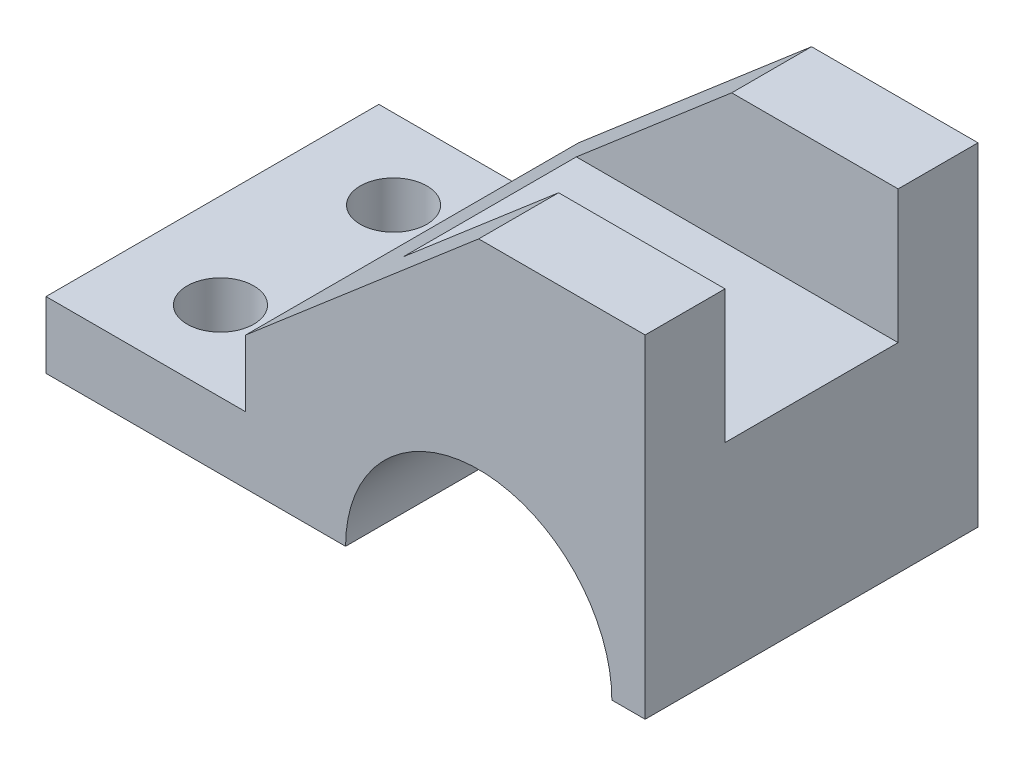
ISO-10303-21;
HEADER;
FILE_DESCRIPTION(('STEP AP214'),'2;1');
FILE_NAME('part.step','',(''),(''),'','','');
FILE_SCHEMA(('AUTOMOTIVE_DESIGN { 1 0 10303 214 1 1 1 1 }'));
ENDSEC;
DATA;
#1=APPLICATION_CONTEXT('core data for automotive mechanical design processes');
#2=APPLICATION_PROTOCOL_DEFINITION('international standard','automotive_design',2000,#1);
#3=PRODUCT_CONTEXT('',#1,'mechanical');
#4=PRODUCT('Part','Part','',(#3));
#5=PRODUCT_RELATED_PRODUCT_CATEGORY('part','',(#4));
#6=PRODUCT_DEFINITION_FORMATION('','',#4);
#7=PRODUCT_DEFINITION_CONTEXT('part definition',#1,'design');
#8=PRODUCT_DEFINITION('design','',#6,#7);
#9=PRODUCT_DEFINITION_SHAPE('','',#8);
#10=(LENGTH_UNIT() NAMED_UNIT(*) SI_UNIT(.MILLI.,.METRE.));
#11=(NAMED_UNIT(*) PLANE_ANGLE_UNIT() SI_UNIT($,.RADIAN.));
#12=(NAMED_UNIT(*) SI_UNIT($,.STERADIAN.) SOLID_ANGLE_UNIT());
#13=UNCERTAINTY_MEASURE_WITH_UNIT(LENGTH_MEASURE(1.E-05),#10,'distance_accuracy_value','');
#14=(GEOMETRIC_REPRESENTATION_CONTEXT(3) GLOBAL_UNCERTAINTY_ASSIGNED_CONTEXT((#13)) GLOBAL_UNIT_ASSIGNED_CONTEXT((#10,
#11,#12)) REPRESENTATION_CONTEXT('',''));
#15=CARTESIAN_POINT('',(0.,0.,0.));
#16=DIRECTION('',(0.,0.,1.));
#17=DIRECTION('',(1.,0.,0.));
#18=AXIS2_PLACEMENT_3D('',#15,#16,#17);
#19=CARTESIAN_POINT('',(21.0794353078974,28.4104255181365,-50.));
#20=DIRECTION('',(0.,1.,0.));
#21=DIRECTION('',(0.,0.,1.));
#22=AXIS2_PLACEMENT_3D('',#19,#20,#21);
#23=PLANE('',#22);
#24=DIRECTION('',(1.,0.,0.));
#25=VECTOR('',#24,1.);
#26=CARTESIAN_POINT('',(-78.9205646921026,28.4104255181365,-38.));
#27=LINE('',#26,#25);
#28=CARTESIAN_POINT('',(-3.92056469210261,28.4104255181365,-38.));
#29=VERTEX_POINT('',#28);
#30=CARTESIAN_POINT('',(21.0794353078974,28.4104255181365,-38.));
#31=VERTEX_POINT('',#30);
#32=EDGE_CURVE('E251',#29,#31,#27,.T.);
#33=ORIENTED_EDGE('',*,*,#32,.T.);
#34=DIRECTION('',(0.,0.,1.));
#35=VECTOR('',#34,1.);
#36=CARTESIAN_POINT('',(21.0794353078974,28.4104255181365,-50.));
#37=LINE('',#36,#35);
#38=CARTESIAN_POINT('',(21.0794353078974,28.4104255181365,-50.));
#39=VERTEX_POINT('',#38);
#40=EDGE_CURVE('E180',#39,#31,#37,.T.);
#41=ORIENTED_EDGE('',*,*,#40,.F.);
#42=DIRECTION('',(-1.,0.,0.));
#43=VECTOR('',#42,1.);
#44=CARTESIAN_POINT('',(21.0794353078974,28.4104255181365,-50.));
#45=LINE('',#44,#43);
#46=CARTESIAN_POINT('',(-3.92056469210262,28.4104255181365,-50.));
#47=VERTEX_POINT('',#46);
#48=EDGE_CURVE('E144',#39,#47,#45,.T.);
#49=ORIENTED_EDGE('',*,*,#48,.T.);
#50=DIRECTION('',(0.,0.,1.));
#51=VECTOR('',#50,1.);
#52=CARTESIAN_POINT('',(-3.92056469210262,28.4104255181365,-50.));
#53=LINE('',#52,#51);
#54=EDGE_CURVE('E131',#47,#29,#53,.T.);
#55=ORIENTED_EDGE('',*,*,#54,.T.);
#56=EDGE_LOOP('',(#33,#41,#49,#55));
#57=FACE_BOUND('',#56,.T.);
#58=ADVANCED_FACE('F33',(#57),#23,.T.);
#59=CARTESIAN_POINT('',(-68.9205646921026,-21.5895744818635,-50.));
#60=DIRECTION('',(-1.,0.,0.));
#61=DIRECTION('',(0.,0.,1.));
#62=AXIS2_PLACEMENT_3D('',#59,#60,#61);
#63=PLANE('',#62);
#64=DIRECTION('',(0.,-1.,0.));
#65=VECTOR('',#64,1.);
#66=CARTESIAN_POINT('',(-68.9205646921026,-21.5895744818635,0.));
#67=LINE('',#66,#65);
#68=CARTESIAN_POINT('',(-68.9205646921026,-11.5895744818635,0.));
#69=VERTEX_POINT('',#68);
#70=CARTESIAN_POINT('',(-68.9205646921026,-21.5895744818635,0.));
#71=VERTEX_POINT('',#70);
#72=EDGE_CURVE('E151',#69,#71,#67,.T.);
#73=ORIENTED_EDGE('',*,*,#72,.F.);
#74=DIRECTION('',(0.,0.,1.));
#75=VECTOR('',#74,1.);
#76=CARTESIAN_POINT('',(-68.9205646921026,-11.5895744818635,-50.));
#77=LINE('',#76,#75);
#78=CARTESIAN_POINT('',(-68.9205646921026,-11.5895744818635,-50.));
#79=VERTEX_POINT('',#78);
#80=EDGE_CURVE('E11',#79,#69,#77,.T.);
#81=ORIENTED_EDGE('',*,*,#80,.F.);
#82=DIRECTION('',(0.,-1.,0.));
#83=VECTOR('',#82,1.);
#84=CARTESIAN_POINT('',(-68.9205646921026,-21.5895744818635,-50.));
#85=LINE('',#84,#83);
#86=CARTESIAN_POINT('',(-68.9205646921026,-21.5895744818635,-50.));
#87=VERTEX_POINT('',#86);
#88=EDGE_CURVE('E175',#79,#87,#85,.T.);
#89=ORIENTED_EDGE('',*,*,#88,.T.);
#90=DIRECTION('',(0.,0.,1.));
#91=VECTOR('',#90,1.);
#92=CARTESIAN_POINT('',(-68.9205646921026,-21.5895744818635,-50.));
#93=LINE('',#92,#91);
#94=EDGE_CURVE('E37',#87,#71,#93,.T.);
#95=ORIENTED_EDGE('',*,*,#94,.T.);
#96=EDGE_LOOP('',(#73,#81,#89,#95));
#97=FACE_BOUND('',#96,.T.);
#98=ADVANCED_FACE('F35',(#97),#63,.T.);
#99=CARTESIAN_POINT('',(-68.9205646921026,-11.5895744818635,-50.));
#100=DIRECTION('',(0.,1.,0.));
#101=DIRECTION('',(0.,0.,1.));
#102=AXIS2_PLACEMENT_3D('',#99,#100,#101);
#103=PLANE('',#102);
#104=CARTESIAN_POINT('',(-54.7121009661851,-11.5895744818635,-12.));
#105=DIRECTION('',(0.,1.,0.));
#106=DIRECTION('',(0.,0.,-1.));
#107=AXIS2_PLACEMENT_3D('',#104,#105,#106);
#108=CIRCLE('',#107,5.);
#109=CARTESIAN_POINT('',(-54.7121009661851,-11.5895744818635,-17.));
#110=VERTEX_POINT('',#109);
#111=EDGE_CURVE('E265',#110,#110,#108,.T.);
#112=ORIENTED_EDGE('',*,*,#111,.F.);
#113=EDGE_LOOP('',(#112));
#114=FACE_BOUND('',#113,.T.);
#115=CARTESIAN_POINT('',(-54.7121009661851,-11.5895744818635,-38.));
#116=DIRECTION('',(0.,1.,0.));
#117=DIRECTION('',(0.,0.,1.));
#118=AXIS2_PLACEMENT_3D('',#115,#116,#117);
#119=CIRCLE('',#118,5.);
#120=CARTESIAN_POINT('',(-54.7121009661851,-11.5895744818635,-33.));
#121=VERTEX_POINT('',#120);
#122=EDGE_CURVE('E269',#121,#121,#119,.T.);
#123=ORIENTED_EDGE('',*,*,#122,.F.);
#124=EDGE_LOOP('',(#123));
#125=FACE_BOUND('',#124,.T.);
#126=DIRECTION('',(-1.,0.,0.));
#127=VECTOR('',#126,1.);
#128=CARTESIAN_POINT('',(-68.9205646921026,-11.5895744818635,0.));
#129=LINE('',#128,#127);
#130=CARTESIAN_POINT('',(-38.9205646921026,-11.5895744818635,0.));
#131=VERTEX_POINT('',#130);
#132=EDGE_CURVE('E173',#131,#69,#129,.T.);
#133=ORIENTED_EDGE('',*,*,#132,.F.);
#134=DIRECTION('',(0.,0.,1.));
#135=VECTOR('',#134,1.);
#136=CARTESIAN_POINT('',(-38.9205646921026,-11.5895744818635,-50.));
#137=LINE('',#136,#135);
#138=CARTESIAN_POINT('',(-38.9205646921026,-11.5895744818635,-50.));
#139=VERTEX_POINT('',#138);
#140=EDGE_CURVE('E42',#139,#131,#137,.T.);
#141=ORIENTED_EDGE('',*,*,#140,.F.);
#142=DIRECTION('',(-1.,0.,0.));
#143=VECTOR('',#142,1.);
#144=CARTESIAN_POINT('',(-68.9205646921026,-11.5895744818635,-50.));
#145=LINE('',#144,#143);
#146=EDGE_CURVE('E139',#139,#79,#145,.T.);
#147=ORIENTED_EDGE('',*,*,#146,.T.);
#148=ORIENTED_EDGE('',*,*,#80,.T.);
#149=EDGE_LOOP('',(#133,#141,#147,#148));
#150=FACE_BOUND('',#149,.T.);
#151=ADVANCED_FACE('F192',(#114,#125,#150),#103,.T.);
#152=CARTESIAN_POINT('',(-38.9205646921026,-11.5895744818635,-50.));
#153=DIRECTION('',(-1.,0.,0.));
#154=DIRECTION('',(0.,0.,1.));
#155=AXIS2_PLACEMENT_3D('',#152,#153,#154);
#156=PLANE('',#155);
#157=DIRECTION('',(0.,-1.,0.));
#158=VECTOR('',#157,1.);
#159=CARTESIAN_POINT('',(-38.9205646921026,-11.5895744818635,0.));
#160=LINE('',#159,#158);
#161=CARTESIAN_POINT('',(-38.9205646921026,-1.58957448186347,0.));
#162=VERTEX_POINT('',#161);
#163=EDGE_CURVE('E126',#162,#131,#160,.T.);
#164=ORIENTED_EDGE('',*,*,#163,.F.);
#165=DIRECTION('',(0.,0.,1.));
#166=VECTOR('',#165,1.);
#167=CARTESIAN_POINT('',(-38.9205646921026,-1.58957448186347,-50.));
#168=LINE('',#167,#166);
#169=CARTESIAN_POINT('',(-38.9205646921026,-1.58957448186347,-50.));
#170=VERTEX_POINT('',#169);
#171=EDGE_CURVE('E120',#170,#162,#168,.T.);
#172=ORIENTED_EDGE('',*,*,#171,.F.);
#173=DIRECTION('',(0.,-1.,0.));
#174=VECTOR('',#173,1.);
#175=CARTESIAN_POINT('',(-38.9205646921026,-11.5895744818635,-50.));
#176=LINE('',#175,#174);
#177=EDGE_CURVE('E123',#170,#139,#176,.T.);
#178=ORIENTED_EDGE('',*,*,#177,.T.);
#179=ORIENTED_EDGE('',*,*,#140,.T.);
#180=EDGE_LOOP('',(#164,#172,#178,#179));
#181=FACE_BOUND('',#180,.T.);
#182=ADVANCED_FACE('F122',(#181),#156,.T.);
#183=CARTESIAN_POINT('',(-38.9205646921026,-1.58957448186347,-50.));
#184=DIRECTION('',(-0.650791373455969,0.759256602365297,0.));
#185=DIRECTION('',(-0.759256602365296,-0.650791373455969,0.));
#186=AXIS2_PLACEMENT_3D('',#183,#184,#185);
#187=PLANE('',#186);
#188=DIRECTION('',(-0.759256602365296,-0.650791373455969,0.));
#189=VECTOR('',#188,1.);
#190=CARTESIAN_POINT('',(-38.9205646921026,-1.58957448186347,-38.));
#191=LINE('',#190,#189);
#192=CARTESIAN_POINT('',(-27.253898025436,8.41042551813654,-38.));
#193=VERTEX_POINT('',#192);
#194=EDGE_CURVE('E262',#29,#193,#191,.T.);
#195=ORIENTED_EDGE('',*,*,#194,.F.);
#196=ORIENTED_EDGE('',*,*,#54,.F.);
#197=DIRECTION('',(-0.759256602365297,-0.650791373455969,0.));
#198=VECTOR('',#197,1.);
#199=CARTESIAN_POINT('',(-38.9205646921026,-1.58957448186347,-50.));
#200=LINE('',#199,#198);
#201=EDGE_CURVE('E137',#47,#170,#200,.T.);
#202=ORIENTED_EDGE('',*,*,#201,.T.);
#203=ORIENTED_EDGE('',*,*,#171,.T.);
#204=DIRECTION('',(-0.759256602365297,-0.650791373455969,0.));
#205=VECTOR('',#204,1.);
#206=CARTESIAN_POINT('',(-38.9205646921026,-1.58957448186347,0.));
#207=LINE('',#206,#205);
#208=CARTESIAN_POINT('',(-3.92056469210262,28.4104255181365,0.));
#209=VERTEX_POINT('',#208);
#210=EDGE_CURVE('E170',#209,#162,#207,.T.);
#211=ORIENTED_EDGE('',*,*,#210,.F.);
#212=CARTESIAN_POINT('',(-3.92056469210261,28.4104255181365,-12.));
#213=VERTEX_POINT('',#212);
#214=EDGE_CURVE('E179',#213,#209,#53,.T.);
#215=ORIENTED_EDGE('',*,*,#214,.F.);
#216=DIRECTION('',(0.759256602365296,0.650791373455969,0.));
#217=VECTOR('',#216,1.);
#218=CARTESIAN_POINT('',(-38.9205646921026,-1.58957448186346,-12.));
#219=LINE('',#218,#217);
#220=CARTESIAN_POINT('',(-27.2538980254359,8.41042551813654,-12.));
#221=VERTEX_POINT('',#220);
#222=EDGE_CURVE('E234',#221,#213,#219,.T.);
#223=ORIENTED_EDGE('',*,*,#222,.F.);
#224=DIRECTION('',(0.,0.,1.));
#225=VECTOR('',#224,1.);
#226=CARTESIAN_POINT('',(-27.253898025436,8.41042551813654,-50.));
#227=LINE('',#226,#225);
#228=EDGE_CURVE('E259',#193,#221,#227,.T.);
#229=ORIENTED_EDGE('',*,*,#228,.F.);
#230=EDGE_LOOP('',(#195,#196,#202,#203,#211,#215,#223,#229));
#231=FACE_BOUND('',#230,.T.);
#232=ADVANCED_FACE('F142',(#231),#187,.T.);
#233=DIRECTION('',(1.,0.,0.));
#234=VECTOR('',#233,1.);
#235=CARTESIAN_POINT('',(-78.9205646921026,28.4104255181365,-12.));
#236=LINE('',#235,#234);
#237=CARTESIAN_POINT('',(21.0794353078974,28.4104255181365,-12.));
#238=VERTEX_POINT('',#237);
#239=EDGE_CURVE('E50',#213,#238,#236,.T.);
#240=ORIENTED_EDGE('',*,*,#239,.F.);
#241=ORIENTED_EDGE('',*,*,#214,.T.);
#242=DIRECTION('',(-1.,0.,0.));
#243=VECTOR('',#242,1.);
#244=CARTESIAN_POINT('',(21.0794353078974,28.4104255181365,0.));
#245=LINE('',#244,#243);
#246=CARTESIAN_POINT('',(21.0794353078974,28.4104255181365,0.));
#247=VERTEX_POINT('',#246);
#248=EDGE_CURVE('E167',#247,#209,#245,.T.);
#249=ORIENTED_EDGE('',*,*,#248,.F.);
#250=EDGE_CURVE('E183',#238,#247,#37,.T.);
#251=ORIENTED_EDGE('',*,*,#250,.F.);
#252=EDGE_LOOP('',(#240,#241,#249,#251));
#253=FACE_BOUND('',#252,.T.);
#254=ADVANCED_FACE('F207',(#253),#23,.T.);
#255=CARTESIAN_POINT('',(21.0794353078974,-21.5895744818635,-50.));
#256=DIRECTION('',(1.,0.,0.));
#257=DIRECTION('',(0.,0.,-1.));
#258=AXIS2_PLACEMENT_3D('',#255,#256,#257);
#259=PLANE('',#258);
#260=DIRECTION('',(0.,1.,0.));
#261=VECTOR('',#260,1.);
#262=CARTESIAN_POINT('',(21.0794353078974,8.41042551813654,-38.));
#263=LINE('',#262,#261);
#264=CARTESIAN_POINT('',(21.0794353078974,8.41042551813654,-38.));
#265=VERTEX_POINT('',#264);
#266=EDGE_CURVE('E230',#265,#31,#263,.T.);
#267=ORIENTED_EDGE('',*,*,#266,.F.);
#268=DIRECTION('',(0.,0.,-1.));
#269=VECTOR('',#268,1.);
#270=CARTESIAN_POINT('',(21.0794353078974,8.41042551813654,-12.));
#271=LINE('',#270,#269);
#272=CARTESIAN_POINT('',(21.0794353078974,8.41042551813654,-12.));
#273=VERTEX_POINT('',#272);
#274=EDGE_CURVE('E244',#273,#265,#271,.T.);
#275=ORIENTED_EDGE('',*,*,#274,.F.);
#276=DIRECTION('',(0.,-1.,0.));
#277=VECTOR('',#276,1.);
#278=CARTESIAN_POINT('',(21.0794353078974,28.4104255181365,-12.));
#279=LINE('',#278,#277);
#280=EDGE_CURVE('E241',#238,#273,#279,.T.);
#281=ORIENTED_EDGE('',*,*,#280,.F.);
#282=ORIENTED_EDGE('',*,*,#250,.T.);
#283=DIRECTION('',(0.,1.,0.));
#284=VECTOR('',#283,1.);
#285=CARTESIAN_POINT('',(21.0794353078974,-21.5895744818635,0.));
#286=LINE('',#285,#284);
#287=CARTESIAN_POINT('',(21.0794353078974,-21.5895744818635,0.));
#288=VERTEX_POINT('',#287);
#289=EDGE_CURVE('E164',#288,#247,#286,.T.);
#290=ORIENTED_EDGE('',*,*,#289,.F.);
#291=DIRECTION('',(0.,0.,1.));
#292=VECTOR('',#291,1.);
#293=CARTESIAN_POINT('',(21.0794353078974,-21.5895744818635,-50.));
#294=LINE('',#293,#292);
#295=CARTESIAN_POINT('',(21.0794353078974,-21.5895744818635,-50.));
#296=VERTEX_POINT('',#295);
#297=EDGE_CURVE('E184',#296,#288,#294,.T.);
#298=ORIENTED_EDGE('',*,*,#297,.F.);
#299=DIRECTION('',(0.,1.,0.));
#300=VECTOR('',#299,1.);
#301=CARTESIAN_POINT('',(21.0794353078974,-21.5895744818635,-50.));
#302=LINE('',#301,#300);
#303=EDGE_CURVE('E146',#296,#39,#302,.T.);
#304=ORIENTED_EDGE('',*,*,#303,.T.);
#305=ORIENTED_EDGE('',*,*,#40,.T.);
#306=EDGE_LOOP('',(#267,#275,#281,#282,#290,#298,#304,#305));
#307=FACE_BOUND('',#306,.T.);
#308=ADVANCED_FACE('F214',(#307),#259,.T.);
#309=CARTESIAN_POINT('',(16.0794353078974,-21.5895744818635,-50.));
#310=DIRECTION('',(0.,-1.,0.));
#311=DIRECTION('',(0.,0.,-1.));
#312=AXIS2_PLACEMENT_3D('',#309,#310,#311);
#313=PLANE('',#312);
#314=DIRECTION('',(1.,0.,0.));
#315=VECTOR('',#314,1.);
#316=CARTESIAN_POINT('',(16.0794353078974,-21.5895744818635,0.));
#317=LINE('',#316,#315);
#318=CARTESIAN_POINT('',(16.0794353078974,-21.5895744818635,0.));
#319=VERTEX_POINT('',#318);
#320=EDGE_CURVE('E161',#319,#288,#317,.T.);
#321=ORIENTED_EDGE('',*,*,#320,.F.);
#322=DIRECTION('',(0.,0.,1.));
#323=VECTOR('',#322,1.);
#324=CARTESIAN_POINT('',(16.0794353078974,-21.5895744818635,-50.));
#325=LINE('',#324,#323);
#326=CARTESIAN_POINT('',(16.0794353078974,-21.5895744818635,-50.));
#327=VERTEX_POINT('',#326);
#328=EDGE_CURVE('E186',#327,#319,#325,.T.);
#329=ORIENTED_EDGE('',*,*,#328,.F.);
#330=DIRECTION('',(1.,0.,0.));
#331=VECTOR('',#330,1.);
#332=CARTESIAN_POINT('',(16.0794353078974,-21.5895744818635,-50.));
#333=LINE('',#332,#331);
#334=EDGE_CURVE('E282',#327,#296,#333,.T.);
#335=ORIENTED_EDGE('',*,*,#334,.T.);
#336=ORIENTED_EDGE('',*,*,#297,.T.);
#337=EDGE_LOOP('',(#321,#329,#335,#336));
#338=FACE_BOUND('',#337,.T.);
#339=ADVANCED_FACE('F220',(#338),#313,.T.);
#340=CARTESIAN_POINT('',(-3.92056469210262,-21.5895744818635,-50.));
#341=DIRECTION('',(0.,0.,1.));
#342=DIRECTION('',(1.,0.,0.));
#343=AXIS2_PLACEMENT_3D('',#340,#341,#342);
#344=CYLINDRICAL_SURFACE('',#343,20.);
#345=CARTESIAN_POINT('',(-3.92056469210262,-21.5895744818635,0.));
#346=DIRECTION('',(0.,0.,-1.));
#347=DIRECTION('',(-1.,0.,0.));
#348=AXIS2_PLACEMENT_3D('',#345,#346,#347);
#349=CIRCLE('',#348,20.);
#350=CARTESIAN_POINT('',(-23.9205646921026,-21.5895744818635,0.));
#351=VERTEX_POINT('',#350);
#352=EDGE_CURVE('E158',#351,#319,#349,.T.);
#353=ORIENTED_EDGE('',*,*,#352,.F.);
#354=DIRECTION('',(0.,0.,1.));
#355=VECTOR('',#354,1.);
#356=CARTESIAN_POINT('',(-23.9205646921026,-21.5895744818635,-50.));
#357=LINE('',#356,#355);
#358=CARTESIAN_POINT('',(-23.9205646921026,-21.5895744818635,-50.));
#359=VERTEX_POINT('',#358);
#360=EDGE_CURVE('E187',#359,#351,#357,.T.);
#361=ORIENTED_EDGE('',*,*,#360,.F.);
#362=CARTESIAN_POINT('',(-3.92056469210262,-21.5895744818635,-50.));
#363=DIRECTION('',(0.,0.,-1.));
#364=DIRECTION('',(-1.,0.,0.));
#365=AXIS2_PLACEMENT_3D('',#362,#363,#364);
#366=CIRCLE('',#365,20.);
#367=EDGE_CURVE('E279',#359,#327,#366,.T.);
#368=ORIENTED_EDGE('',*,*,#367,.T.);
#369=ORIENTED_EDGE('',*,*,#328,.T.);
#370=EDGE_LOOP('',(#353,#361,#368,#369));
#371=FACE_BOUND('',#370,.T.);
#372=ADVANCED_FACE('F288',(#371),#344,.F.);
#373=CARTESIAN_POINT('',(-68.9205646921026,-21.5895744818635,-50.));
#374=DIRECTION('',(0.,-1.,0.));
#375=DIRECTION('',(0.,0.,-1.));
#376=AXIS2_PLACEMENT_3D('',#373,#374,#375);
#377=PLANE('',#376);
#378=CARTESIAN_POINT('',(-54.7121009661851,-21.5895744818635,-12.));
#379=DIRECTION('',(0.,1.,0.));
#380=DIRECTION('',(0.,0.,-1.));
#381=AXIS2_PLACEMENT_3D('',#378,#379,#380);
#382=CIRCLE('',#381,5.);
#383=CARTESIAN_POINT('',(-54.7121009661851,-21.5895744818635,-17.));
#384=VERTEX_POINT('',#383);
#385=EDGE_CURVE('E266',#384,#384,#382,.T.);
#386=ORIENTED_EDGE('',*,*,#385,.T.);
#387=EDGE_LOOP('',(#386));
#388=FACE_BOUND('',#387,.T.);
#389=CARTESIAN_POINT('',(-54.7121009661851,-21.5895744818635,-38.));
#390=DIRECTION('',(0.,1.,0.));
#391=DIRECTION('',(0.,0.,1.));
#392=AXIS2_PLACEMENT_3D('',#389,#390,#391);
#393=CIRCLE('',#392,5.);
#394=CARTESIAN_POINT('',(-54.7121009661851,-21.5895744818635,-33.));
#395=VERTEX_POINT('',#394);
#396=EDGE_CURVE('E155',#395,#395,#393,.T.);
#397=ORIENTED_EDGE('',*,*,#396,.T.);
#398=EDGE_LOOP('',(#397));
#399=FACE_BOUND('',#398,.T.);
#400=DIRECTION('',(1.,0.,0.));
#401=VECTOR('',#400,1.);
#402=CARTESIAN_POINT('',(-68.9205646921026,-21.5895744818635,0.));
#403=LINE('',#402,#401);
#404=EDGE_CURVE('E154',#71,#351,#403,.T.);
#405=ORIENTED_EDGE('',*,*,#404,.F.);
#406=ORIENTED_EDGE('',*,*,#94,.F.);
#407=DIRECTION('',(1.,0.,0.));
#408=VECTOR('',#407,1.);
#409=CARTESIAN_POINT('',(-68.9205646921026,-21.5895744818635,-50.));
#410=LINE('',#409,#408);
#411=EDGE_CURVE('E277',#87,#359,#410,.T.);
#412=ORIENTED_EDGE('',*,*,#411,.T.);
#413=ORIENTED_EDGE('',*,*,#360,.T.);
#414=EDGE_LOOP('',(#405,#406,#412,#413));
#415=FACE_BOUND('',#414,.T.);
#416=ADVANCED_FACE('F189',(#388,#399,#415),#377,.T.);
#417=CARTESIAN_POINT('',(-3.92056469210262,-21.5895744818635,-50.));
#418=DIRECTION('',(0.,0.,-1.));
#419=DIRECTION('',(-1.,0.,0.));
#420=AXIS2_PLACEMENT_3D('',#417,#418,#419);
#421=PLANE('',#420);
#422=ORIENTED_EDGE('',*,*,#88,.F.);
#423=ORIENTED_EDGE('',*,*,#146,.F.);
#424=ORIENTED_EDGE('',*,*,#177,.F.);
#425=ORIENTED_EDGE('',*,*,#201,.F.);
#426=ORIENTED_EDGE('',*,*,#48,.F.);
#427=ORIENTED_EDGE('',*,*,#303,.F.);
#428=ORIENTED_EDGE('',*,*,#334,.F.);
#429=ORIENTED_EDGE('',*,*,#367,.F.);
#430=ORIENTED_EDGE('',*,*,#411,.F.);
#431=EDGE_LOOP('',(#422,#423,#424,#425,#426,#427,#428,#429,#430));
#432=FACE_BOUND('',#431,.T.);
#433=ADVANCED_FACE('F135',(#432),#421,.T.);
#434=CARTESIAN_POINT('',(-3.92056469210262,-21.5895744818635,0.));
#435=DIRECTION('',(0.,0.,-1.));
#436=DIRECTION('',(-1.,0.,0.));
#437=AXIS2_PLACEMENT_3D('',#434,#435,#436);
#438=PLANE('',#437);
#439=ORIENTED_EDGE('',*,*,#72,.T.);
#440=ORIENTED_EDGE('',*,*,#404,.T.);
#441=ORIENTED_EDGE('',*,*,#352,.T.);
#442=ORIENTED_EDGE('',*,*,#320,.T.);
#443=ORIENTED_EDGE('',*,*,#289,.T.);
#444=ORIENTED_EDGE('',*,*,#248,.T.);
#445=ORIENTED_EDGE('',*,*,#210,.T.);
#446=ORIENTED_EDGE('',*,*,#163,.T.);
#447=ORIENTED_EDGE('',*,*,#132,.T.);
#448=EDGE_LOOP('',(#439,#440,#441,#442,#443,#444,#445,#446,#447));
#449=FACE_BOUND('',#448,.T.);
#450=ADVANCED_FACE('F191',(#449),#438,.F.);
#451=CARTESIAN_POINT('',(-54.7121009661851,-21.5895744818635,-38.));
#452=DIRECTION('',(0.,1.,0.));
#453=DIRECTION('',(0.,0.,1.));
#454=AXIS2_PLACEMENT_3D('',#451,#452,#453);
#455=CYLINDRICAL_SURFACE('',#454,5.);
#456=ORIENTED_EDGE('',*,*,#396,.F.);
#457=EDGE_LOOP('',(#456));
#458=FACE_BOUND('',#457,.T.);
#459=ORIENTED_EDGE('',*,*,#122,.T.);
#460=EDGE_LOOP('',(#459));
#461=FACE_BOUND('',#460,.T.);
#462=ADVANCED_FACE('F345',(#458,#461),#455,.F.);
#463=CARTESIAN_POINT('',(-54.7121009661851,-21.5895744818635,-12.));
#464=DIRECTION('',(0.,1.,0.));
#465=DIRECTION('',(0.,0.,1.));
#466=AXIS2_PLACEMENT_3D('',#463,#464,#465);
#467=CYLINDRICAL_SURFACE('',#466,5.);
#468=ORIENTED_EDGE('',*,*,#385,.F.);
#469=EDGE_LOOP('',(#468));
#470=FACE_BOUND('',#469,.T.);
#471=ORIENTED_EDGE('',*,*,#111,.T.);
#472=EDGE_LOOP('',(#471));
#473=FACE_BOUND('',#472,.T.);
#474=ADVANCED_FACE('F318',(#470,#473),#467,.F.);
#475=CARTESIAN_POINT('',(-78.9205646921026,8.41042551813654,-38.));
#476=DIRECTION('',(0.,0.,-1.));
#477=DIRECTION('',(-1.,0.,0.));
#478=AXIS2_PLACEMENT_3D('',#475,#476,#477);
#479=PLANE('',#478);
#480=ORIENTED_EDGE('',*,*,#194,.T.);
#481=DIRECTION('',(1.,0.,0.));
#482=VECTOR('',#481,1.);
#483=CARTESIAN_POINT('',(-78.9205646921026,8.41042551813654,-38.));
#484=LINE('',#483,#482);
#485=EDGE_CURVE('E253',#193,#265,#484,.T.);
#486=ORIENTED_EDGE('',*,*,#485,.T.);
#487=ORIENTED_EDGE('',*,*,#266,.T.);
#488=ORIENTED_EDGE('',*,*,#32,.F.);
#489=EDGE_LOOP('',(#480,#486,#487,#488));
#490=FACE_BOUND('',#489,.T.);
#491=ADVANCED_FACE('F312',(#490),#479,.F.);
#492=CARTESIAN_POINT('',(-78.9205646921026,8.41042551813654,-12.));
#493=DIRECTION('',(0.,-1.,0.));
#494=DIRECTION('',(0.,0.,-1.));
#495=AXIS2_PLACEMENT_3D('',#492,#493,#494);
#496=PLANE('',#495);
#497=ORIENTED_EDGE('',*,*,#228,.T.);
#498=DIRECTION('',(1.,0.,0.));
#499=VECTOR('',#498,1.);
#500=CARTESIAN_POINT('',(-78.9205646921026,8.41042551813654,-12.));
#501=LINE('',#500,#499);
#502=EDGE_CURVE('E229',#221,#273,#501,.T.);
#503=ORIENTED_EDGE('',*,*,#502,.T.);
#504=ORIENTED_EDGE('',*,*,#274,.T.);
#505=ORIENTED_EDGE('',*,*,#485,.F.);
#506=EDGE_LOOP('',(#497,#503,#504,#505));
#507=FACE_BOUND('',#506,.T.);
#508=ADVANCED_FACE('F317',(#507),#496,.F.);
#509=CARTESIAN_POINT('',(-78.9205646921026,28.4104255181365,-12.));
#510=DIRECTION('',(0.,0.,1.));
#511=DIRECTION('',(0.,-1.,0.));
#512=AXIS2_PLACEMENT_3D('',#509,#510,#511);
#513=PLANE('',#512);
#514=ORIENTED_EDGE('',*,*,#222,.T.);
#515=ORIENTED_EDGE('',*,*,#239,.T.);
#516=ORIENTED_EDGE('',*,*,#280,.T.);
#517=ORIENTED_EDGE('',*,*,#502,.F.);
#518=EDGE_LOOP('',(#514,#515,#516,#517));
#519=FACE_BOUND('',#518,.T.);
#520=ADVANCED_FACE('F330',(#519),#513,.F.);
#521=CLOSED_SHELL('',(#58,#98,#151,#182,#232,#254,#308,#339,#372,#416,#433,#450,#462,#474,#491,
#508,#520));
#522=MANIFOLD_SOLID_BREP('B2',#521);
#523=ADVANCED_BREP_SHAPE_REPRESENTATION('',(#18,#522),#14);
#524=SHAPE_DEFINITION_REPRESENTATION(#9,#523);
ENDSEC;
END-ISO-10303-21;
